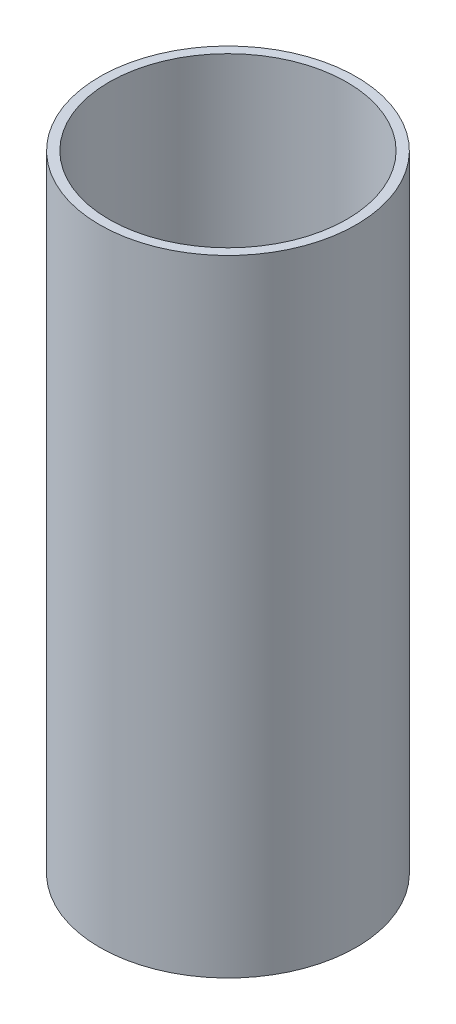
ISO-10303-21;
HEADER;
FILE_DESCRIPTION(('STEP AP214'),'2;1');
FILE_NAME('part.step','',(''),(''),'','','');
FILE_SCHEMA(('AUTOMOTIVE_DESIGN { 1 0 10303 214 1 1 1 1 }'));
ENDSEC;
DATA;
#1=APPLICATION_CONTEXT('core data for automotive mechanical design processes');
#2=APPLICATION_PROTOCOL_DEFINITION('international standard','automotive_design',2000,#1);
#3=PRODUCT_CONTEXT('',#1,'mechanical');
#4=PRODUCT('Part','Part','',(#3));
#5=PRODUCT_RELATED_PRODUCT_CATEGORY('part','',(#4));
#6=PRODUCT_DEFINITION_FORMATION('','',#4);
#7=PRODUCT_DEFINITION_CONTEXT('part definition',#1,'design');
#8=PRODUCT_DEFINITION('design','',#6,#7);
#9=PRODUCT_DEFINITION_SHAPE('','',#8);
#10=(LENGTH_UNIT() NAMED_UNIT(*) SI_UNIT(.MILLI.,.METRE.));
#11=(NAMED_UNIT(*) PLANE_ANGLE_UNIT() SI_UNIT($,.RADIAN.));
#12=(NAMED_UNIT(*) SI_UNIT($,.STERADIAN.) SOLID_ANGLE_UNIT());
#13=UNCERTAINTY_MEASURE_WITH_UNIT(LENGTH_MEASURE(1.E-05),#10,'distance_accuracy_value','');
#14=(GEOMETRIC_REPRESENTATION_CONTEXT(3) GLOBAL_UNCERTAINTY_ASSIGNED_CONTEXT((#13)) GLOBAL_UNIT_ASSIGNED_CONTEXT((#10,
#11,#12)) REPRESENTATION_CONTEXT('',''));
#15=CARTESIAN_POINT('',(0.,0.,0.));
#16=DIRECTION('',(0.,0.,1.));
#17=DIRECTION('',(1.,0.,0.));
#18=AXIS2_PLACEMENT_3D('',#15,#16,#17);
#19=CARTESIAN_POINT('',(0.,100.,0.));
#20=DIRECTION('',(0.,1.,0.));
#21=DIRECTION('',(0.,0.,1.));
#22=AXIS2_PLACEMENT_3D('',#19,#20,#21);
#23=PLANE('',#22);
#24=CARTESIAN_POINT('',(0.,100.,0.));
#25=DIRECTION('',(0.,1.,0.));
#26=DIRECTION('',(0.,0.,1.));
#27=AXIS2_PLACEMENT_3D('',#24,#25,#26);
#28=CIRCLE('',#27,20.5);
#29=CARTESIAN_POINT('',(0.,100.,20.5));
#30=VERTEX_POINT('',#29);
#31=EDGE_CURVE('E10',#30,#30,#28,.T.);
#32=ORIENTED_EDGE('',*,*,#31,.T.);
#33=EDGE_LOOP('',(#32));
#34=FACE_BOUND('',#33,.T.);
#35=CARTESIAN_POINT('',(0.,100.,0.));
#36=DIRECTION('',(0.,1.,0.));
#37=DIRECTION('',(0.,0.,1.));
#38=AXIS2_PLACEMENT_3D('',#35,#36,#37);
#39=CIRCLE('',#38,19.);
#40=CARTESIAN_POINT('',(0.,100.,19.));
#41=VERTEX_POINT('',#40);
#42=EDGE_CURVE('E54',#41,#41,#39,.T.);
#43=ORIENTED_EDGE('',*,*,#42,.F.);
#44=EDGE_LOOP('',(#43));
#45=FACE_BOUND('',#44,.T.);
#46=ADVANCED_FACE('F41',(#34,#45),#23,.T.);
#47=CARTESIAN_POINT('',(0.,0.,0.));
#48=DIRECTION('',(0.,1.,0.));
#49=DIRECTION('',(0.,0.,1.));
#50=AXIS2_PLACEMENT_3D('',#47,#48,#49);
#51=PLANE('',#50);
#52=CARTESIAN_POINT('',(0.,0.,0.));
#53=DIRECTION('',(0.,1.,0.));
#54=DIRECTION('',(0.,0.,1.));
#55=AXIS2_PLACEMENT_3D('',#52,#53,#54);
#56=CIRCLE('',#55,20.5);
#57=CARTESIAN_POINT('',(0.,0.,20.5));
#58=VERTEX_POINT('',#57);
#59=EDGE_CURVE('E45',#58,#58,#56,.T.);
#60=ORIENTED_EDGE('',*,*,#59,.F.);
#61=EDGE_LOOP('',(#60));
#62=FACE_BOUND('',#61,.T.);
#63=CARTESIAN_POINT('',(0.,0.,0.));
#64=DIRECTION('',(0.,1.,0.));
#65=DIRECTION('',(0.,0.,1.));
#66=AXIS2_PLACEMENT_3D('',#63,#64,#65);
#67=CIRCLE('',#66,19.);
#68=CARTESIAN_POINT('',(0.,0.,19.));
#69=VERTEX_POINT('',#68);
#70=EDGE_CURVE('E56',#69,#69,#67,.T.);
#71=ORIENTED_EDGE('',*,*,#70,.T.);
#72=EDGE_LOOP('',(#71));
#73=FACE_BOUND('',#72,.T.);
#74=ADVANCED_FACE('F68',(#62,#73),#51,.F.);
#75=CARTESIAN_POINT('',(0.,100.,0.));
#76=DIRECTION('',(0.,-1.,0.));
#77=DIRECTION('',(0.,0.,-1.));
#78=AXIS2_PLACEMENT_3D('',#75,#76,#77);
#79=CYLINDRICAL_SURFACE('',#78,20.5);
#80=ORIENTED_EDGE('',*,*,#31,.F.);
#81=EDGE_LOOP('',(#80));
#82=FACE_BOUND('',#81,.T.);
#83=ORIENTED_EDGE('',*,*,#59,.T.);
#84=EDGE_LOOP('',(#83));
#85=FACE_BOUND('',#84,.T.);
#86=ADVANCED_FACE('F43',(#82,#85),#79,.T.);
#87=CARTESIAN_POINT('',(0.,100.,0.));
#88=DIRECTION('',(0.,-1.,0.));
#89=DIRECTION('',(0.,0.,-1.));
#90=AXIS2_PLACEMENT_3D('',#87,#88,#89);
#91=CYLINDRICAL_SURFACE('',#90,19.);
#92=ORIENTED_EDGE('',*,*,#42,.T.);
#93=EDGE_LOOP('',(#92));
#94=FACE_BOUND('',#93,.T.);
#95=ORIENTED_EDGE('',*,*,#70,.F.);
#96=EDGE_LOOP('',(#95));
#97=FACE_BOUND('',#96,.T.);
#98=ADVANCED_FACE('F64',(#94,#97),#91,.F.);
#99=CLOSED_SHELL('',(#46,#74,#86,#98));
#100=MANIFOLD_SOLID_BREP('B2',#99);
#101=ADVANCED_BREP_SHAPE_REPRESENTATION('',(#18,#100),#14);
#102=SHAPE_DEFINITION_REPRESENTATION(#9,#101);
ENDSEC;
END-ISO-10303-21;
